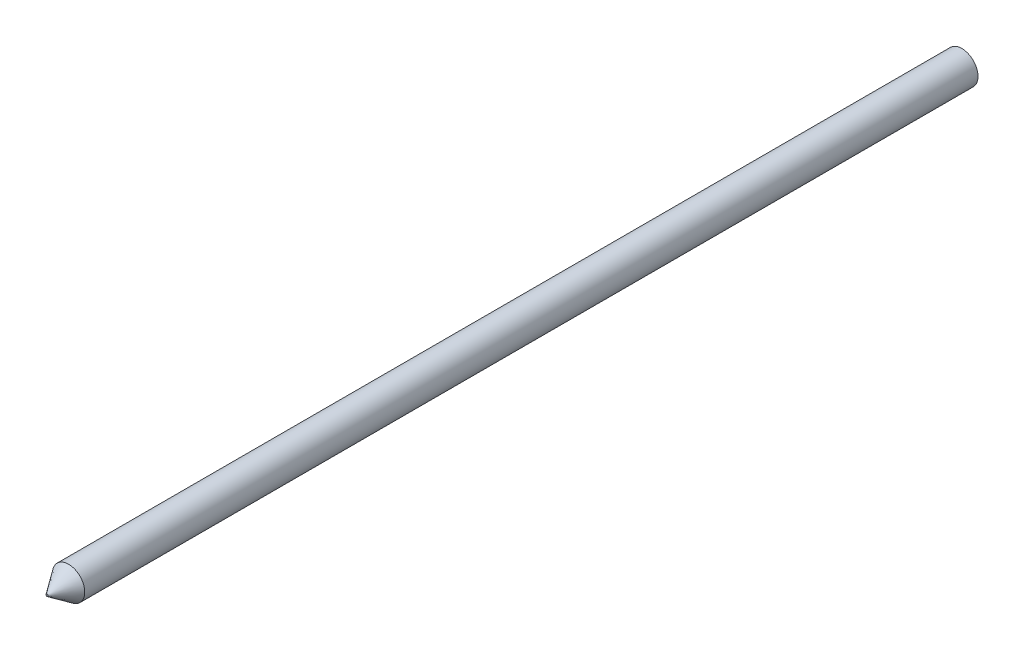
ISO-10303-21;
HEADER;
FILE_DESCRIPTION(('STEP AP214'),'2;1');
FILE_NAME('part.step','',(''),(''),'','','');
FILE_SCHEMA(('AUTOMOTIVE_DESIGN { 1 0 10303 214 1 1 1 1 }'));
ENDSEC;
DATA;
#1=APPLICATION_CONTEXT('core data for automotive mechanical design processes');
#2=APPLICATION_PROTOCOL_DEFINITION('international standard','automotive_design',2000,#1);
#3=PRODUCT_CONTEXT('',#1,'mechanical');
#4=PRODUCT('Part','Part','',(#3));
#5=PRODUCT_RELATED_PRODUCT_CATEGORY('part','',(#4));
#6=PRODUCT_DEFINITION_FORMATION('','',#4);
#7=PRODUCT_DEFINITION_CONTEXT('part definition',#1,'design');
#8=PRODUCT_DEFINITION('design','',#6,#7);
#9=PRODUCT_DEFINITION_SHAPE('','',#8);
#10=(LENGTH_UNIT() NAMED_UNIT(*) SI_UNIT(.MILLI.,.METRE.));
#11=(NAMED_UNIT(*) PLANE_ANGLE_UNIT() SI_UNIT($,.RADIAN.));
#12=(NAMED_UNIT(*) SI_UNIT($,.STERADIAN.) SOLID_ANGLE_UNIT());
#13=UNCERTAINTY_MEASURE_WITH_UNIT(LENGTH_MEASURE(1.E-05),#10,'distance_accuracy_value','');
#14=(GEOMETRIC_REPRESENTATION_CONTEXT(3) GLOBAL_UNCERTAINTY_ASSIGNED_CONTEXT((#13)) GLOBAL_UNIT_ASSIGNED_CONTEXT((#10,
#11,#12)) REPRESENTATION_CONTEXT('',''));
#15=CARTESIAN_POINT('',(0.,0.,0.));
#16=DIRECTION('',(0.,0.,1.));
#17=DIRECTION('',(1.,0.,0.));
#18=AXIS2_PLACEMENT_3D('',#15,#16,#17);
#19=CARTESIAN_POINT('',(0.,0.,170.));
#20=DIRECTION('',(0.,0.,-1.));
#21=DIRECTION('',(-1.,0.,0.));
#22=AXIS2_PLACEMENT_3D('',#19,#20,#21);
#23=CYLINDRICAL_SURFACE('',#22,3.);
#24=CARTESIAN_POINT('',(0.,0.,166.));
#25=DIRECTION('',(0.,0.,1.));
#26=DIRECTION('',(1.,0.,0.));
#27=AXIS2_PLACEMENT_3D('',#24,#25,#26);
#28=CIRCLE('',#27,3.);
#29=CARTESIAN_POINT('',(3.,0.,166.));
#30=VERTEX_POINT('',#29);
#31=EDGE_CURVE('E10',#30,#30,#28,.F.);
#32=ORIENTED_EDGE('',*,*,#31,.T.);
#33=EDGE_LOOP('',(#32));
#34=FACE_BOUND('',#33,.T.);
#35=CARTESIAN_POINT('',(0.,0.,0.));
#36=DIRECTION('',(0.,0.,1.));
#37=DIRECTION('',(1.,0.,0.));
#38=AXIS2_PLACEMENT_3D('',#35,#36,#37);
#39=CIRCLE('',#38,3.);
#40=CARTESIAN_POINT('',(3.,0.,0.));
#41=VERTEX_POINT('',#40);
#42=EDGE_CURVE('E39',#41,#41,#39,.T.);
#43=ORIENTED_EDGE('',*,*,#42,.T.);
#44=EDGE_LOOP('',(#43));
#45=FACE_BOUND('',#44,.T.);
#46=ADVANCED_FACE('F29',(#34,#45),#23,.T.);
#47=CARTESIAN_POINT('',(0.,0.,170.));
#48=DIRECTION('',(0.,0.,1.));
#49=DIRECTION('',(1.,0.,0.));
#50=AXIS2_PLACEMENT_3D('',#47,#48,#49);
#51=PLANE('',#50);
#52=CARTESIAN_POINT('',(0.,0.,170.));
#53=DIRECTION('',(0.,0.,1.));
#54=DIRECTION('',(1.,0.,0.));
#55=AXIS2_PLACEMENT_3D('',#52,#53,#54);
#56=CIRCLE('',#55,0.199169847161132);
#57=CARTESIAN_POINT('',(0.199169847161132,0.,170.));
#58=VERTEX_POINT('',#57);
#59=EDGE_CURVE('E35',#58,#58,#56,.T.);
#60=ORIENTED_EDGE('',*,*,#59,.T.);
#61=EDGE_LOOP('',(#60));
#62=FACE_BOUND('',#61,.T.);
#63=ADVANCED_FACE('F50',(#62),#51,.T.);
#64=CARTESIAN_POINT('',(0.,0.,0.));
#65=DIRECTION('',(0.,0.,1.));
#66=DIRECTION('',(1.,0.,0.));
#67=AXIS2_PLACEMENT_3D('',#64,#65,#66);
#68=PLANE('',#67);
#69=ORIENTED_EDGE('',*,*,#42,.F.);
#70=EDGE_LOOP('',(#69));
#71=FACE_BOUND('',#70,.T.);
#72=ADVANCED_FACE('F47',(#71),#68,.F.);
#73=CARTESIAN_POINT('',(0.,0.,170.));
#74=DIRECTION('',(0.,0.,-1.));
#75=DIRECTION('',(-1.,0.,0.));
#76=AXIS2_PLACEMENT_3D('',#73,#74,#75);
#77=CONICAL_SURFACE('',#76,0.199169847161132,0.61086523819801);
#78=ORIENTED_EDGE('',*,*,#31,.F.);
#79=EDGE_LOOP('',(#78));
#80=FACE_BOUND('',#79,.T.);
#81=ORIENTED_EDGE('',*,*,#59,.F.);
#82=EDGE_LOOP('',(#81));
#83=FACE_BOUND('',#82,.T.);
#84=ADVANCED_FACE('F49',(#80,#83),#77,.T.);
#85=CLOSED_SHELL('',(#46,#63,#72,#84));
#86=MANIFOLD_SOLID_BREP('B2',#85);
#87=ADVANCED_BREP_SHAPE_REPRESENTATION('',(#18,#86),#14);
#88=SHAPE_DEFINITION_REPRESENTATION(#9,#87);
ENDSEC;
END-ISO-10303-21;
